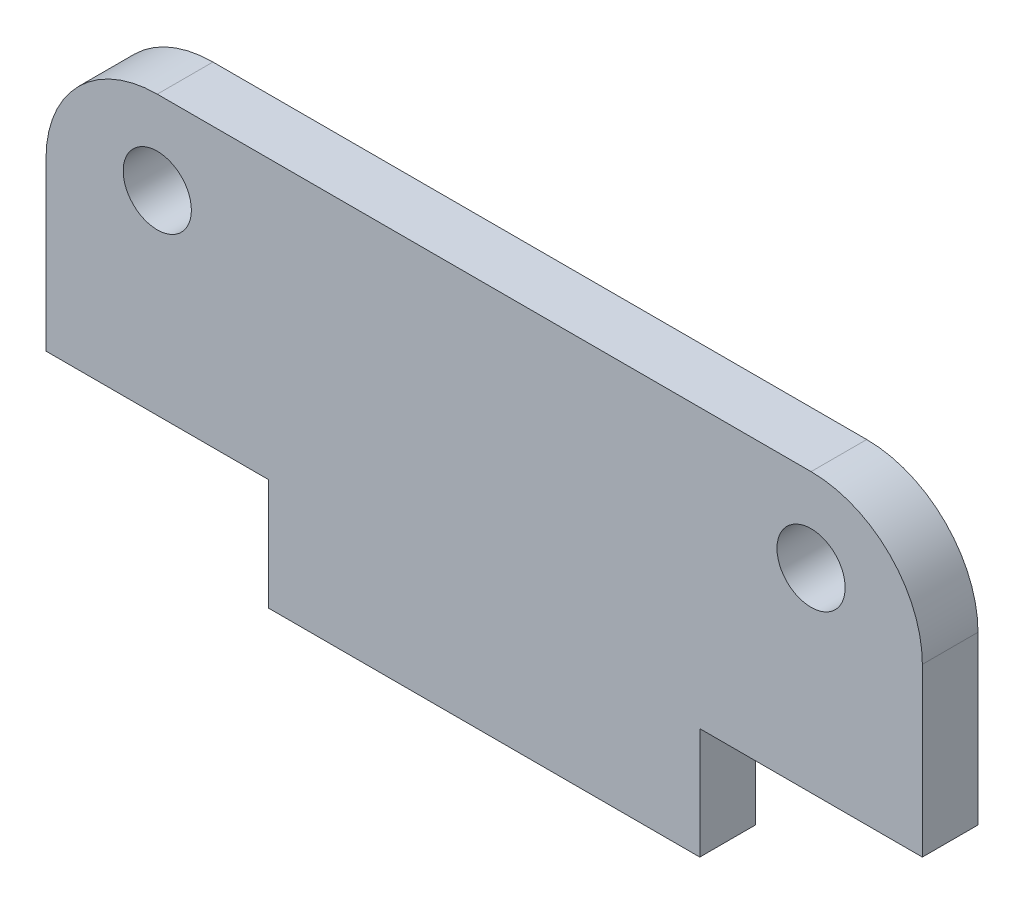
ISO-10303-21;
HEADER;
FILE_DESCRIPTION(('STEP AP214'),'2;1');
FILE_NAME('part.step','',(''),(''),'','','');
FILE_SCHEMA(('AUTOMOTIVE_DESIGN { 1 0 10303 214 1 1 1 1 }'));
ENDSEC;
DATA;
#1=APPLICATION_CONTEXT('core data for automotive mechanical design processes');
#2=APPLICATION_PROTOCOL_DEFINITION('international standard','automotive_design',2000,#1);
#3=PRODUCT_CONTEXT('',#1,'mechanical');
#4=PRODUCT('Part','Part','',(#3));
#5=PRODUCT_RELATED_PRODUCT_CATEGORY('part','',(#4));
#6=PRODUCT_DEFINITION_FORMATION('','',#4);
#7=PRODUCT_DEFINITION_CONTEXT('part definition',#1,'design');
#8=PRODUCT_DEFINITION('design','',#6,#7);
#9=PRODUCT_DEFINITION_SHAPE('','',#8);
#10=(LENGTH_UNIT() NAMED_UNIT(*) SI_UNIT(.MILLI.,.METRE.));
#11=(NAMED_UNIT(*) PLANE_ANGLE_UNIT() SI_UNIT($,.RADIAN.));
#12=(NAMED_UNIT(*) SI_UNIT($,.STERADIAN.) SOLID_ANGLE_UNIT());
#13=UNCERTAINTY_MEASURE_WITH_UNIT(LENGTH_MEASURE(1.E-05),#10,'distance_accuracy_value','');
#14=(GEOMETRIC_REPRESENTATION_CONTEXT(3) GLOBAL_UNCERTAINTY_ASSIGNED_CONTEXT((#13)) GLOBAL_UNIT_ASSIGNED_CONTEXT((#10,
#11,#12)) REPRESENTATION_CONTEXT('',''));
#15=CARTESIAN_POINT('',(0.,0.,0.));
#16=DIRECTION('',(0.,0.,1.));
#17=DIRECTION('',(1.,0.,0.));
#18=AXIS2_PLACEMENT_3D('',#15,#16,#17);
#19=CARTESIAN_POINT('',(11.75,-0.999999999999993,2.));
#20=DIRECTION('',(0.,0.,-1.));
#21=DIRECTION('',(-1.,0.,0.));
#22=AXIS2_PLACEMENT_3D('',#19,#20,#21);
#23=PLANE('',#22);
#24=CARTESIAN_POINT('',(-11.75,0.,2.));
#25=DIRECTION('',(0.,0.,1.));
#26=DIRECTION('',(1.,0.,0.));
#27=AXIS2_PLACEMENT_3D('',#24,#25,#26);
#28=CIRCLE('',#27,1.225);
#29=CARTESIAN_POINT('',(-10.525,0.,2.));
#30=VERTEX_POINT('',#29);
#31=EDGE_CURVE('E145',#30,#30,#28,.T.);
#32=ORIENTED_EDGE('',*,*,#31,.F.);
#33=EDGE_LOOP('',(#32));
#34=FACE_BOUND('',#33,.T.);
#35=CARTESIAN_POINT('',(11.75,-0.999999999999993,2.));
#36=DIRECTION('',(0.,0.,1.));
#37=DIRECTION('',(-1.,0.,0.));
#38=AXIS2_PLACEMENT_3D('',#35,#36,#37);
#39=CIRCLE('',#38,4.);
#40=CARTESIAN_POINT('',(15.75,-0.999999999999994,2.));
#41=VERTEX_POINT('',#40);
#42=CARTESIAN_POINT('',(11.75,3.,2.));
#43=VERTEX_POINT('',#42);
#44=EDGE_CURVE('E160',#41,#43,#39,.T.);
#45=ORIENTED_EDGE('',*,*,#44,.T.);
#46=DIRECTION('',(-1.,0.,0.));
#47=VECTOR('',#46,1.);
#48=CARTESIAN_POINT('',(-11.75,3.,2.));
#49=LINE('',#48,#47);
#50=CARTESIAN_POINT('',(-11.75,3.,2.));
#51=VERTEX_POINT('',#50);
#52=EDGE_CURVE('E98',#43,#51,#49,.T.);
#53=ORIENTED_EDGE('',*,*,#52,.T.);
#54=CARTESIAN_POINT('',(-11.75,-1.,2.));
#55=DIRECTION('',(0.,0.,1.));
#56=DIRECTION('',(1.,0.,0.));
#57=AXIS2_PLACEMENT_3D('',#54,#55,#56);
#58=CIRCLE('',#57,4.);
#59=CARTESIAN_POINT('',(-15.75,-1.,2.));
#60=VERTEX_POINT('',#59);
#61=EDGE_CURVE('E181',#51,#60,#58,.T.);
#62=ORIENTED_EDGE('',*,*,#61,.T.);
#63=DIRECTION('',(0.,-1.,0.));
#64=VECTOR('',#63,1.);
#65=CARTESIAN_POINT('',(-15.75,-1.,2.));
#66=LINE('',#65,#64);
#67=CARTESIAN_POINT('',(-15.75,-7.,2.));
#68=VERTEX_POINT('',#67);
#69=EDGE_CURVE('E200',#60,#68,#66,.T.);
#70=ORIENTED_EDGE('',*,*,#69,.T.);
#71=DIRECTION('',(1.,0.,0.));
#72=VECTOR('',#71,1.);
#73=CARTESIAN_POINT('',(-15.75,-7.,2.));
#74=LINE('',#73,#72);
#75=CARTESIAN_POINT('',(-7.75,-7.,2.));
#76=VERTEX_POINT('',#75);
#77=EDGE_CURVE('E197',#68,#76,#74,.T.);
#78=ORIENTED_EDGE('',*,*,#77,.T.);
#79=DIRECTION('',(0.,-1.,0.));
#80=VECTOR('',#79,1.);
#81=CARTESIAN_POINT('',(-7.75,-11.,2.));
#82=LINE('',#81,#80);
#83=CARTESIAN_POINT('',(-7.75,-11.,2.));
#84=VERTEX_POINT('',#83);
#85=EDGE_CURVE('E199',#76,#84,#82,.T.);
#86=ORIENTED_EDGE('',*,*,#85,.T.);
#87=DIRECTION('',(1.,0.,0.));
#88=VECTOR('',#87,1.);
#89=CARTESIAN_POINT('',(-7.75,-11.,2.));
#90=LINE('',#89,#88);
#91=CARTESIAN_POINT('',(7.75,-11.,2.));
#92=VERTEX_POINT('',#91);
#93=EDGE_CURVE('E123',#84,#92,#90,.T.);
#94=ORIENTED_EDGE('',*,*,#93,.T.);
#95=DIRECTION('',(0.,1.,0.));
#96=VECTOR('',#95,1.);
#97=CARTESIAN_POINT('',(7.75,-11.,2.));
#98=LINE('',#97,#96);
#99=CARTESIAN_POINT('',(7.75,-6.99999999999999,2.));
#100=VERTEX_POINT('',#99);
#101=EDGE_CURVE('E117',#92,#100,#98,.T.);
#102=ORIENTED_EDGE('',*,*,#101,.T.);
#103=DIRECTION('',(1.,0.,0.));
#104=VECTOR('',#103,1.);
#105=CARTESIAN_POINT('',(15.75,-6.99999999999999,2.));
#106=LINE('',#105,#104);
#107=CARTESIAN_POINT('',(15.75,-6.99999999999999,2.));
#108=VERTEX_POINT('',#107);
#109=EDGE_CURVE('E121',#100,#108,#106,.T.);
#110=ORIENTED_EDGE('',*,*,#109,.T.);
#111=DIRECTION('',(0.,1.,0.));
#112=VECTOR('',#111,1.);
#113=CARTESIAN_POINT('',(15.75,-0.999999999999994,2.));
#114=LINE('',#113,#112);
#115=EDGE_CURVE('E49',#108,#41,#114,.T.);
#116=ORIENTED_EDGE('',*,*,#115,.T.);
#117=EDGE_LOOP('',(#45,#53,#62,#70,#78,#86,#94,#102,#110,#116));
#118=FACE_BOUND('',#117,.T.);
#119=CARTESIAN_POINT('',(11.75,0.,2.));
#120=DIRECTION('',(0.,0.,1.));
#121=DIRECTION('',(-1.,0.,0.));
#122=AXIS2_PLACEMENT_3D('',#119,#120,#121);
#123=CIRCLE('',#122,1.225);
#124=CARTESIAN_POINT('',(10.525,0.,2.));
#125=VERTEX_POINT('',#124);
#126=EDGE_CURVE('E211',#125,#125,#123,.T.);
#127=ORIENTED_EDGE('',*,*,#126,.F.);
#128=EDGE_LOOP('',(#127));
#129=FACE_BOUND('',#128,.T.);
#130=ADVANCED_FACE('F32',(#34,#118,#129),#23,.F.);
#131=CARTESIAN_POINT('',(11.75,-0.999999999999993,0.));
#132=DIRECTION('',(0.,0.,-1.));
#133=DIRECTION('',(-1.,0.,0.));
#134=AXIS2_PLACEMENT_3D('',#131,#132,#133);
#135=PLANE('',#134);
#136=CARTESIAN_POINT('',(-11.75,0.,0.));
#137=DIRECTION('',(0.,0.,1.));
#138=DIRECTION('',(1.,0.,0.));
#139=AXIS2_PLACEMENT_3D('',#136,#137,#138);
#140=CIRCLE('',#139,1.225);
#141=CARTESIAN_POINT('',(-10.525,0.,0.));
#142=VERTEX_POINT('',#141);
#143=EDGE_CURVE('E208',#142,#142,#140,.T.);
#144=ORIENTED_EDGE('',*,*,#143,.T.);
#145=EDGE_LOOP('',(#144));
#146=FACE_BOUND('',#145,.T.);
#147=CARTESIAN_POINT('',(11.75,-0.999999999999993,0.));
#148=DIRECTION('',(0.,0.,1.));
#149=DIRECTION('',(-1.,0.,0.));
#150=AXIS2_PLACEMENT_3D('',#147,#148,#149);
#151=CIRCLE('',#150,4.);
#152=CARTESIAN_POINT('',(15.75,-0.999999999999994,0.));
#153=VERTEX_POINT('',#152);
#154=CARTESIAN_POINT('',(11.75,3.,0.));
#155=VERTEX_POINT('',#154);
#156=EDGE_CURVE('E141',#153,#155,#151,.T.);
#157=ORIENTED_EDGE('',*,*,#156,.F.);
#158=DIRECTION('',(0.,1.,0.));
#159=VECTOR('',#158,1.);
#160=CARTESIAN_POINT('',(15.75,-0.999999999999994,0.));
#161=LINE('',#160,#159);
#162=CARTESIAN_POINT('',(15.75,-6.99999999999999,0.));
#163=VERTEX_POINT('',#162);
#164=EDGE_CURVE('E90',#163,#153,#161,.T.);
#165=ORIENTED_EDGE('',*,*,#164,.F.);
#166=DIRECTION('',(1.,0.,0.));
#167=VECTOR('',#166,1.);
#168=CARTESIAN_POINT('',(15.75,-6.99999999999999,0.));
#169=LINE('',#168,#167);
#170=CARTESIAN_POINT('',(7.75,-6.99999999999999,0.));
#171=VERTEX_POINT('',#170);
#172=EDGE_CURVE('E84',#171,#163,#169,.T.);
#173=ORIENTED_EDGE('',*,*,#172,.F.);
#174=DIRECTION('',(0.,1.,0.));
#175=VECTOR('',#174,1.);
#176=CARTESIAN_POINT('',(7.75,-11.,0.));
#177=LINE('',#176,#175);
#178=CARTESIAN_POINT('',(7.75,-11.,0.));
#179=VERTEX_POINT('',#178);
#180=EDGE_CURVE('E131',#179,#171,#177,.T.);
#181=ORIENTED_EDGE('',*,*,#180,.F.);
#182=DIRECTION('',(1.,0.,0.));
#183=VECTOR('',#182,1.);
#184=CARTESIAN_POINT('',(-7.75,-11.,0.));
#185=LINE('',#184,#183);
#186=CARTESIAN_POINT('',(-7.75,-11.,0.));
#187=VERTEX_POINT('',#186);
#188=EDGE_CURVE('E155',#187,#179,#185,.T.);
#189=ORIENTED_EDGE('',*,*,#188,.F.);
#190=DIRECTION('',(0.,-1.,0.));
#191=VECTOR('',#190,1.);
#192=CARTESIAN_POINT('',(-7.75,-11.,0.));
#193=LINE('',#192,#191);
#194=CARTESIAN_POINT('',(-7.75,-7.,0.));
#195=VERTEX_POINT('',#194);
#196=EDGE_CURVE('E153',#195,#187,#193,.T.);
#197=ORIENTED_EDGE('',*,*,#196,.F.);
#198=DIRECTION('',(1.,0.,0.));
#199=VECTOR('',#198,1.);
#200=CARTESIAN_POINT('',(-15.75,-7.,0.));
#201=LINE('',#200,#199);
#202=CARTESIAN_POINT('',(-15.75,-7.,0.));
#203=VERTEX_POINT('',#202);
#204=EDGE_CURVE('E151',#203,#195,#201,.T.);
#205=ORIENTED_EDGE('',*,*,#204,.F.);
#206=DIRECTION('',(0.,-1.,0.));
#207=VECTOR('',#206,1.);
#208=CARTESIAN_POINT('',(-15.75,-1.,0.));
#209=LINE('',#208,#207);
#210=CARTESIAN_POINT('',(-15.75,-1.,0.));
#211=VERTEX_POINT('',#210);
#212=EDGE_CURVE('E149',#211,#203,#209,.T.);
#213=ORIENTED_EDGE('',*,*,#212,.F.);
#214=CARTESIAN_POINT('',(-11.75,-1.,0.));
#215=DIRECTION('',(0.,0.,1.));
#216=DIRECTION('',(1.,0.,0.));
#217=AXIS2_PLACEMENT_3D('',#214,#215,#216);
#218=CIRCLE('',#217,4.);
#219=CARTESIAN_POINT('',(-11.75,3.,0.));
#220=VERTEX_POINT('',#219);
#221=EDGE_CURVE('E147',#220,#211,#218,.T.);
#222=ORIENTED_EDGE('',*,*,#221,.F.);
#223=DIRECTION('',(-1.,0.,0.));
#224=VECTOR('',#223,1.);
#225=CARTESIAN_POINT('',(-11.75,3.,0.));
#226=LINE('',#225,#224);
#227=EDGE_CURVE('E144',#155,#220,#226,.T.);
#228=ORIENTED_EDGE('',*,*,#227,.F.);
#229=EDGE_LOOP('',(#157,#165,#173,#181,#189,#197,#205,#213,#222,#228));
#230=FACE_BOUND('',#229,.T.);
#231=CARTESIAN_POINT('',(11.75,0.,0.));
#232=DIRECTION('',(0.,0.,1.));
#233=DIRECTION('',(-1.,0.,0.));
#234=AXIS2_PLACEMENT_3D('',#231,#232,#233);
#235=CIRCLE('',#234,1.225);
#236=CARTESIAN_POINT('',(10.525,0.,0.));
#237=VERTEX_POINT('',#236);
#238=EDGE_CURVE('E214',#237,#237,#235,.T.);
#239=ORIENTED_EDGE('',*,*,#238,.T.);
#240=EDGE_LOOP('',(#239));
#241=FACE_BOUND('',#240,.T.);
#242=ADVANCED_FACE('F185',(#146,#230,#241),#135,.T.);
#243=CARTESIAN_POINT('',(11.75,-0.999999999999993,2.));
#244=DIRECTION('',(0.,0.,-1.));
#245=DIRECTION('',(-1.,0.,0.));
#246=AXIS2_PLACEMENT_3D('',#243,#244,#245);
#247=CYLINDRICAL_SURFACE('',#246,4.);
#248=ORIENTED_EDGE('',*,*,#156,.T.);
#249=DIRECTION('',(0.,0.,-1.));
#250=VECTOR('',#249,1.);
#251=CARTESIAN_POINT('',(11.75,3.,2.));
#252=LINE('',#251,#250);
#253=EDGE_CURVE('E11',#43,#155,#252,.T.);
#254=ORIENTED_EDGE('',*,*,#253,.F.);
#255=ORIENTED_EDGE('',*,*,#44,.F.);
#256=DIRECTION('',(0.,0.,-1.));
#257=VECTOR('',#256,1.);
#258=CARTESIAN_POINT('',(15.75,-0.999999999999994,2.));
#259=LINE('',#258,#257);
#260=EDGE_CURVE('E137',#41,#153,#259,.T.);
#261=ORIENTED_EDGE('',*,*,#260,.T.);
#262=EDGE_LOOP('',(#248,#254,#255,#261));
#263=FACE_BOUND('',#262,.T.);
#264=ADVANCED_FACE('F34',(#263),#247,.T.);
#265=CARTESIAN_POINT('',(-11.75,3.,2.));
#266=DIRECTION('',(0.,-1.,0.));
#267=DIRECTION('',(1.,0.,0.));
#268=AXIS2_PLACEMENT_3D('',#265,#266,#267);
#269=PLANE('',#268);
#270=ORIENTED_EDGE('',*,*,#227,.T.);
#271=DIRECTION('',(0.,0.,-1.));
#272=VECTOR('',#271,1.);
#273=CARTESIAN_POINT('',(-11.75,3.,2.));
#274=LINE('',#273,#272);
#275=EDGE_CURVE('E41',#51,#220,#274,.T.);
#276=ORIENTED_EDGE('',*,*,#275,.F.);
#277=ORIENTED_EDGE('',*,*,#52,.F.);
#278=ORIENTED_EDGE('',*,*,#253,.T.);
#279=EDGE_LOOP('',(#270,#276,#277,#278));
#280=FACE_BOUND('',#279,.T.);
#281=ADVANCED_FACE('F255',(#280),#269,.F.);
#282=CARTESIAN_POINT('',(-11.75,-1.,2.));
#283=DIRECTION('',(0.,0.,-1.));
#284=DIRECTION('',(-1.,0.,0.));
#285=AXIS2_PLACEMENT_3D('',#282,#283,#284);
#286=CYLINDRICAL_SURFACE('',#285,4.);
#287=ORIENTED_EDGE('',*,*,#221,.T.);
#288=DIRECTION('',(0.,0.,-1.));
#289=VECTOR('',#288,1.);
#290=CARTESIAN_POINT('',(-15.75,-1.,2.));
#291=LINE('',#290,#289);
#292=EDGE_CURVE('E173',#60,#211,#291,.T.);
#293=ORIENTED_EDGE('',*,*,#292,.F.);
#294=ORIENTED_EDGE('',*,*,#61,.F.);
#295=ORIENTED_EDGE('',*,*,#275,.T.);
#296=EDGE_LOOP('',(#287,#293,#294,#295));
#297=FACE_BOUND('',#296,.T.);
#298=ADVANCED_FACE('F179',(#297),#286,.T.);
#299=CARTESIAN_POINT('',(-15.75,-1.,2.));
#300=DIRECTION('',(1.,0.,0.));
#301=DIRECTION('',(0.,0.,-1.));
#302=AXIS2_PLACEMENT_3D('',#299,#300,#301);
#303=PLANE('',#302);
#304=ORIENTED_EDGE('',*,*,#212,.T.);
#305=DIRECTION('',(0.,0.,-1.));
#306=VECTOR('',#305,1.);
#307=CARTESIAN_POINT('',(-15.75,-7.,2.));
#308=LINE('',#307,#306);
#309=EDGE_CURVE('E170',#68,#203,#308,.T.);
#310=ORIENTED_EDGE('',*,*,#309,.F.);
#311=ORIENTED_EDGE('',*,*,#69,.F.);
#312=ORIENTED_EDGE('',*,*,#292,.T.);
#313=EDGE_LOOP('',(#304,#310,#311,#312));
#314=FACE_BOUND('',#313,.T.);
#315=ADVANCED_FACE('F191',(#314),#303,.F.);
#316=CARTESIAN_POINT('',(-15.75,-7.,2.));
#317=DIRECTION('',(0.,1.,0.));
#318=DIRECTION('',(0.,0.,1.));
#319=AXIS2_PLACEMENT_3D('',#316,#317,#318);
#320=PLANE('',#319);
#321=ORIENTED_EDGE('',*,*,#204,.T.);
#322=DIRECTION('',(0.,0.,-1.));
#323=VECTOR('',#322,1.);
#324=CARTESIAN_POINT('',(-7.75,-7.,2.));
#325=LINE('',#324,#323);
#326=EDGE_CURVE('E167',#76,#195,#325,.T.);
#327=ORIENTED_EDGE('',*,*,#326,.F.);
#328=ORIENTED_EDGE('',*,*,#77,.F.);
#329=ORIENTED_EDGE('',*,*,#309,.T.);
#330=EDGE_LOOP('',(#321,#327,#328,#329));
#331=FACE_BOUND('',#330,.T.);
#332=ADVANCED_FACE('F195',(#331),#320,.F.);
#333=CARTESIAN_POINT('',(-7.75,-11.,2.));
#334=DIRECTION('',(1.,0.,0.));
#335=DIRECTION('',(0.,0.,-1.));
#336=AXIS2_PLACEMENT_3D('',#333,#334,#335);
#337=PLANE('',#336);
#338=ORIENTED_EDGE('',*,*,#196,.T.);
#339=DIRECTION('',(0.,0.,-1.));
#340=VECTOR('',#339,1.);
#341=CARTESIAN_POINT('',(-7.75,-11.,2.));
#342=LINE('',#341,#340);
#343=EDGE_CURVE('E164',#84,#187,#342,.T.);
#344=ORIENTED_EDGE('',*,*,#343,.F.);
#345=ORIENTED_EDGE('',*,*,#85,.F.);
#346=ORIENTED_EDGE('',*,*,#326,.T.);
#347=EDGE_LOOP('',(#338,#344,#345,#346));
#348=FACE_BOUND('',#347,.T.);
#349=ADVANCED_FACE('F245',(#348),#337,.F.);
#350=CARTESIAN_POINT('',(-7.75,-11.,2.));
#351=DIRECTION('',(0.,1.,0.));
#352=DIRECTION('',(-1.,0.,0.));
#353=AXIS2_PLACEMENT_3D('',#350,#351,#352);
#354=PLANE('',#353);
#355=ORIENTED_EDGE('',*,*,#188,.T.);
#356=DIRECTION('',(0.,0.,-1.));
#357=VECTOR('',#356,1.);
#358=CARTESIAN_POINT('',(7.75,-11.,2.));
#359=LINE('',#358,#357);
#360=EDGE_CURVE('E132',#92,#179,#359,.T.);
#361=ORIENTED_EDGE('',*,*,#360,.F.);
#362=ORIENTED_EDGE('',*,*,#93,.F.);
#363=ORIENTED_EDGE('',*,*,#343,.T.);
#364=EDGE_LOOP('',(#355,#361,#362,#363));
#365=FACE_BOUND('',#364,.T.);
#366=ADVANCED_FACE('F242',(#365),#354,.F.);
#367=CARTESIAN_POINT('',(7.75,-11.,2.));
#368=DIRECTION('',(-1.,0.,0.));
#369=DIRECTION('',(0.,-1.,0.));
#370=AXIS2_PLACEMENT_3D('',#367,#368,#369);
#371=PLANE('',#370);
#372=ORIENTED_EDGE('',*,*,#180,.T.);
#373=DIRECTION('',(0.,0.,-1.));
#374=VECTOR('',#373,1.);
#375=CARTESIAN_POINT('',(7.75,-6.99999999999999,2.));
#376=LINE('',#375,#374);
#377=EDGE_CURVE('E128',#100,#171,#376,.T.);
#378=ORIENTED_EDGE('',*,*,#377,.F.);
#379=ORIENTED_EDGE('',*,*,#101,.F.);
#380=ORIENTED_EDGE('',*,*,#360,.T.);
#381=EDGE_LOOP('',(#372,#378,#379,#380));
#382=FACE_BOUND('',#381,.T.);
#383=ADVANCED_FACE('F129',(#382),#371,.F.);
#384=CARTESIAN_POINT('',(15.75,-6.99999999999999,2.));
#385=DIRECTION('',(0.,1.,0.));
#386=DIRECTION('',(0.,0.,1.));
#387=AXIS2_PLACEMENT_3D('',#384,#385,#386);
#388=PLANE('',#387);
#389=ORIENTED_EDGE('',*,*,#172,.T.);
#390=DIRECTION('',(0.,0.,-1.));
#391=VECTOR('',#390,1.);
#392=CARTESIAN_POINT('',(15.75,-6.99999999999999,2.));
#393=LINE('',#392,#391);
#394=EDGE_CURVE('E133',#108,#163,#393,.T.);
#395=ORIENTED_EDGE('',*,*,#394,.F.);
#396=ORIENTED_EDGE('',*,*,#109,.F.);
#397=ORIENTED_EDGE('',*,*,#377,.T.);
#398=EDGE_LOOP('',(#389,#395,#396,#397));
#399=FACE_BOUND('',#398,.T.);
#400=ADVANCED_FACE('F135',(#399),#388,.F.);
#401=CARTESIAN_POINT('',(15.75,-0.999999999999994,2.));
#402=DIRECTION('',(-1.,0.,0.));
#403=DIRECTION('',(0.,0.,1.));
#404=AXIS2_PLACEMENT_3D('',#401,#402,#403);
#405=PLANE('',#404);
#406=ORIENTED_EDGE('',*,*,#164,.T.);
#407=ORIENTED_EDGE('',*,*,#260,.F.);
#408=ORIENTED_EDGE('',*,*,#115,.F.);
#409=ORIENTED_EDGE('',*,*,#394,.T.);
#410=EDGE_LOOP('',(#406,#407,#408,#409));
#411=FACE_BOUND('',#410,.T.);
#412=ADVANCED_FACE('F235',(#411),#405,.F.);
#413=CARTESIAN_POINT('',(-11.75,0.,2.));
#414=DIRECTION('',(0.,0.,-1.));
#415=DIRECTION('',(-1.,0.,0.));
#416=AXIS2_PLACEMENT_3D('',#413,#414,#415);
#417=CYLINDRICAL_SURFACE('',#416,1.225);
#418=ORIENTED_EDGE('',*,*,#31,.T.);
#419=EDGE_LOOP('',(#418));
#420=FACE_BOUND('',#419,.T.);
#421=ORIENTED_EDGE('',*,*,#143,.F.);
#422=EDGE_LOOP('',(#421));
#423=FACE_BOUND('',#422,.T.);
#424=ADVANCED_FACE('F232',(#420,#423),#417,.F.);
#425=CARTESIAN_POINT('',(11.75,0.,2.));
#426=DIRECTION('',(0.,0.,-1.));
#427=DIRECTION('',(-1.,0.,0.));
#428=AXIS2_PLACEMENT_3D('',#425,#426,#427);
#429=CYLINDRICAL_SURFACE('',#428,1.225);
#430=ORIENTED_EDGE('',*,*,#126,.T.);
#431=EDGE_LOOP('',(#430));
#432=FACE_BOUND('',#431,.T.);
#433=ORIENTED_EDGE('',*,*,#238,.F.);
#434=EDGE_LOOP('',(#433));
#435=FACE_BOUND('',#434,.T.);
#436=ADVANCED_FACE('F220',(#432,#435),#429,.F.);
#437=CLOSED_SHELL('',(#130,#242,#264,#281,#298,#315,#332,#349,#366,#383,#400,#412,#424,#436));
#438=MANIFOLD_SOLID_BREP('B2',#437);
#439=ADVANCED_BREP_SHAPE_REPRESENTATION('',(#18,#438),#14);
#440=SHAPE_DEFINITION_REPRESENTATION(#9,#439);
ENDSEC;
END-ISO-10303-21;
